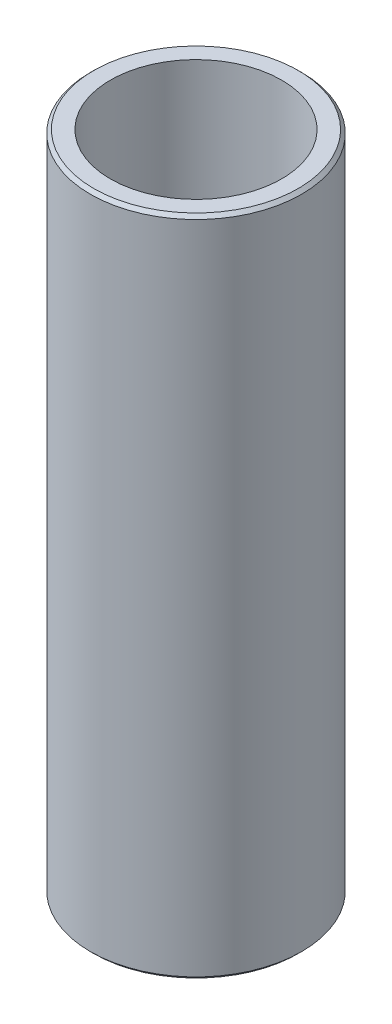
ISO-10303-21;
HEADER;
FILE_DESCRIPTION(('STEP AP214'),'2;1');
FILE_NAME('part.step','',(''),(''),'','','');
FILE_SCHEMA(('AUTOMOTIVE_DESIGN { 1 0 10303 214 1 1 1 1 }'));
ENDSEC;
DATA;
#1=APPLICATION_CONTEXT('core data for automotive mechanical design processes');
#2=APPLICATION_PROTOCOL_DEFINITION('international standard','automotive_design',2000,#1);
#3=PRODUCT_CONTEXT('',#1,'mechanical');
#4=PRODUCT('Part','Part','',(#3));
#5=PRODUCT_RELATED_PRODUCT_CATEGORY('part','',(#4));
#6=PRODUCT_DEFINITION_FORMATION('','',#4);
#7=PRODUCT_DEFINITION_CONTEXT('part definition',#1,'design');
#8=PRODUCT_DEFINITION('design','',#6,#7);
#9=PRODUCT_DEFINITION_SHAPE('','',#8);
#10=(LENGTH_UNIT() NAMED_UNIT(*) SI_UNIT(.MILLI.,.METRE.));
#11=(NAMED_UNIT(*) PLANE_ANGLE_UNIT() SI_UNIT($,.RADIAN.));
#12=(NAMED_UNIT(*) SI_UNIT($,.STERADIAN.) SOLID_ANGLE_UNIT());
#13=UNCERTAINTY_MEASURE_WITH_UNIT(LENGTH_MEASURE(1.E-05),#10,'distance_accuracy_value','');
#14=(GEOMETRIC_REPRESENTATION_CONTEXT(3) GLOBAL_UNCERTAINTY_ASSIGNED_CONTEXT((#13)) GLOBAL_UNIT_ASSIGNED_CONTEXT((#10,
#11,#12)) REPRESENTATION_CONTEXT('',''));
#15=CARTESIAN_POINT('',(0.,0.,0.));
#16=DIRECTION('',(0.,0.,1.));
#17=DIRECTION('',(1.,0.,0.));
#18=AXIS2_PLACEMENT_3D('',#15,#16,#17);
#19=CARTESIAN_POINT('',(0.,49.82,0.));
#20=DIRECTION('',(0.,1.,0.));
#21=DIRECTION('',(0.,0.,1.));
#22=AXIS2_PLACEMENT_3D('',#19,#20,#21);
#23=PLANE('',#22);
#24=CARTESIAN_POINT('',(0.,49.82,0.));
#25=DIRECTION('',(0.,1.,0.));
#26=DIRECTION('',(0.,0.,1.));
#27=AXIS2_PLACEMENT_3D('',#24,#25,#26);
#28=CIRCLE('',#27,7.68999999999999);
#29=CARTESIAN_POINT('',(0.,49.82,7.68999999999999));
#30=VERTEX_POINT('',#29);
#31=EDGE_CURVE('E10',#30,#30,#28,.T.);
#32=ORIENTED_EDGE('',*,*,#31,.T.);
#33=EDGE_LOOP('',(#32));
#34=FACE_BOUND('',#33,.T.);
#35=CARTESIAN_POINT('',(0.,49.82,0.));
#36=DIRECTION('',(0.,1.,0.));
#37=DIRECTION('',(0.,0.,1.));
#38=AXIS2_PLACEMENT_3D('',#35,#36,#37);
#39=CIRCLE('',#38,6.44);
#40=CARTESIAN_POINT('',(0.,49.82,6.44));
#41=VERTEX_POINT('',#40);
#42=EDGE_CURVE('E51',#41,#41,#39,.T.);
#43=ORIENTED_EDGE('',*,*,#42,.F.);
#44=EDGE_LOOP('',(#43));
#45=FACE_BOUND('',#44,.T.);
#46=ADVANCED_FACE('F31',(#34,#45),#23,.T.);
#47=CARTESIAN_POINT('',(0.,0.,0.));
#48=DIRECTION('',(0.,1.,0.));
#49=DIRECTION('',(0.,0.,1.));
#50=AXIS2_PLACEMENT_3D('',#47,#48,#49);
#51=PLANE('',#50);
#52=CARTESIAN_POINT('',(0.,0.,0.));
#53=DIRECTION('',(0.,1.,0.));
#54=DIRECTION('',(0.,0.,1.));
#55=AXIS2_PLACEMENT_3D('',#52,#53,#54);
#56=CIRCLE('',#55,7.69);
#57=CARTESIAN_POINT('',(0.,0.,7.69));
#58=VERTEX_POINT('',#57);
#59=EDGE_CURVE('E38',#58,#58,#56,.F.);
#60=ORIENTED_EDGE('',*,*,#59,.T.);
#61=EDGE_LOOP('',(#60));
#62=FACE_BOUND('',#61,.T.);
#63=CARTESIAN_POINT('',(0.,0.,0.));
#64=DIRECTION('',(0.,1.,0.));
#65=DIRECTION('',(0.,0.,1.));
#66=AXIS2_PLACEMENT_3D('',#63,#64,#65);
#67=CIRCLE('',#66,6.44);
#68=CARTESIAN_POINT('',(0.,0.,6.44));
#69=VERTEX_POINT('',#68);
#70=EDGE_CURVE('E52',#69,#69,#67,.T.);
#71=ORIENTED_EDGE('',*,*,#70,.T.);
#72=EDGE_LOOP('',(#71));
#73=FACE_BOUND('',#72,.T.);
#74=ADVANCED_FACE('F62',(#62,#73),#51,.F.);
#75=CARTESIAN_POINT('',(0.,49.82,0.));
#76=DIRECTION('',(0.,-1.,0.));
#77=DIRECTION('',(0.,0.,-1.));
#78=AXIS2_PLACEMENT_3D('',#75,#76,#77);
#79=CYLINDRICAL_SURFACE('',#78,7.94);
#80=CARTESIAN_POINT('',(0.,0.25,0.));
#81=DIRECTION('',(0.,1.,0.));
#82=DIRECTION('',(0.,0.,1.));
#83=AXIS2_PLACEMENT_3D('',#80,#81,#82);
#84=CIRCLE('',#83,7.94);
#85=CARTESIAN_POINT('',(0.,0.25,7.94));
#86=VERTEX_POINT('',#85);
#87=EDGE_CURVE('E42',#86,#86,#84,.T.);
#88=ORIENTED_EDGE('',*,*,#87,.T.);
#89=EDGE_LOOP('',(#88));
#90=FACE_BOUND('',#89,.T.);
#91=CARTESIAN_POINT('',(0.,49.57,0.));
#92=DIRECTION('',(0.,1.,0.));
#93=DIRECTION('',(0.,0.,1.));
#94=AXIS2_PLACEMENT_3D('',#91,#92,#93);
#95=CIRCLE('',#94,7.94);
#96=CARTESIAN_POINT('',(0.,49.57,7.94));
#97=VERTEX_POINT('',#96);
#98=EDGE_CURVE('E46',#97,#97,#95,.F.);
#99=ORIENTED_EDGE('',*,*,#98,.T.);
#100=EDGE_LOOP('',(#99));
#101=FACE_BOUND('',#100,.T.);
#102=ADVANCED_FACE('F67',(#90,#101),#79,.T.);
#103=CARTESIAN_POINT('',(0.,49.82,0.));
#104=DIRECTION('',(0.,-1.,0.));
#105=DIRECTION('',(0.,0.,-1.));
#106=AXIS2_PLACEMENT_3D('',#103,#104,#105);
#107=CYLINDRICAL_SURFACE('',#106,6.44);
#108=ORIENTED_EDGE('',*,*,#42,.T.);
#109=EDGE_LOOP('',(#108));
#110=FACE_BOUND('',#109,.T.);
#111=ORIENTED_EDGE('',*,*,#70,.F.);
#112=EDGE_LOOP('',(#111));
#113=FACE_BOUND('',#112,.T.);
#114=ADVANCED_FACE('F58',(#110,#113),#107,.F.);
#115=CARTESIAN_POINT('',(0.,0.25,0.));
#116=DIRECTION('',(0.,1.,0.));
#117=DIRECTION('',(0.,0.,1.));
#118=AXIS2_PLACEMENT_3D('',#115,#116,#117);
#119=CONICAL_SURFACE('',#118,7.94,0.785398163397445);
#120=ORIENTED_EDGE('',*,*,#59,.F.);
#121=EDGE_LOOP('',(#120));
#122=FACE_BOUND('',#121,.T.);
#123=ORIENTED_EDGE('',*,*,#87,.F.);
#124=EDGE_LOOP('',(#123));
#125=FACE_BOUND('',#124,.T.);
#126=ADVANCED_FACE('F73',(#122,#125),#119,.T.);
#127=CARTESIAN_POINT('',(0.,49.82,0.));
#128=DIRECTION('',(0.,-1.,0.));
#129=DIRECTION('',(0.,0.,-1.));
#130=AXIS2_PLACEMENT_3D('',#127,#128,#129);
#131=CONICAL_SURFACE('',#130,7.68999999999999,0.785398163397445);
#132=ORIENTED_EDGE('',*,*,#98,.F.);
#133=EDGE_LOOP('',(#132));
#134=FACE_BOUND('',#133,.T.);
#135=ORIENTED_EDGE('',*,*,#31,.F.);
#136=EDGE_LOOP('',(#135));
#137=FACE_BOUND('',#136,.T.);
#138=ADVANCED_FACE('F33',(#134,#137),#131,.T.);
#139=CLOSED_SHELL('',(#46,#74,#102,#114,#126,#138));
#140=MANIFOLD_SOLID_BREP('B2',#139);
#141=ADVANCED_BREP_SHAPE_REPRESENTATION('',(#18,#140),#14);
#142=SHAPE_DEFINITION_REPRESENTATION(#9,#141);
ENDSEC;
END-ISO-10303-21;
